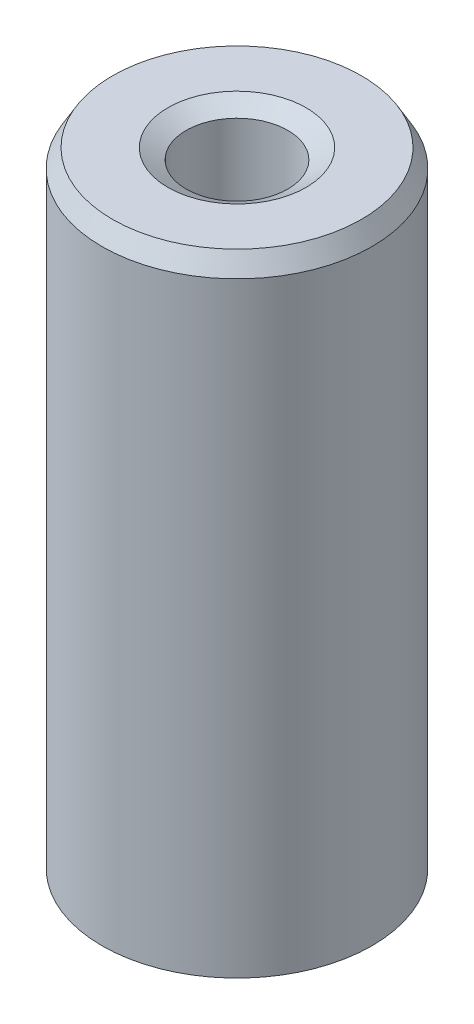
ISO-10303-21;
HEADER;
FILE_DESCRIPTION(('STEP AP214'),'2;1');
FILE_NAME('part.step','',(''),(''),'','','');
FILE_SCHEMA(('AUTOMOTIVE_DESIGN { 1 0 10303 214 1 1 1 1 }'));
ENDSEC;
DATA;
#1=APPLICATION_CONTEXT('core data for automotive mechanical design processes');
#2=APPLICATION_PROTOCOL_DEFINITION('international standard','automotive_design',2000,#1);
#3=PRODUCT_CONTEXT('',#1,'mechanical');
#4=PRODUCT('Part','Part','',(#3));
#5=PRODUCT_RELATED_PRODUCT_CATEGORY('part','',(#4));
#6=PRODUCT_DEFINITION_FORMATION('','',#4);
#7=PRODUCT_DEFINITION_CONTEXT('part definition',#1,'design');
#8=PRODUCT_DEFINITION('design','',#6,#7);
#9=PRODUCT_DEFINITION_SHAPE('','',#8);
#10=(LENGTH_UNIT() NAMED_UNIT(*) SI_UNIT(.MILLI.,.METRE.));
#11=(NAMED_UNIT(*) PLANE_ANGLE_UNIT() SI_UNIT($,.RADIAN.));
#12=(NAMED_UNIT(*) SI_UNIT($,.STERADIAN.) SOLID_ANGLE_UNIT());
#13=UNCERTAINTY_MEASURE_WITH_UNIT(LENGTH_MEASURE(1.E-05),#10,'distance_accuracy_value','');
#14=(GEOMETRIC_REPRESENTATION_CONTEXT(3) GLOBAL_UNCERTAINTY_ASSIGNED_CONTEXT((#13)) GLOBAL_UNIT_ASSIGNED_CONTEXT((#10,
#11,#12)) REPRESENTATION_CONTEXT('',''));
#15=CARTESIAN_POINT('',(0.,0.,0.));
#16=DIRECTION('',(0.,0.,1.));
#17=DIRECTION('',(1.,0.,0.));
#18=AXIS2_PLACEMENT_3D('',#15,#16,#17);
#19=CARTESIAN_POINT('',(0.,117.474514255396,0.));
#20=DIRECTION('',(0.,-1.,0.));
#21=DIRECTION('',(0.,0.,-1.));
#22=AXIS2_PLACEMENT_3D('',#19,#20,#21);
#23=CYLINDRICAL_SURFACE('',#22,25.);
#24=CARTESIAN_POINT('',(0.,1.95128905700256,0.));
#25=DIRECTION('',(0.,1.,0.));
#26=DIRECTION('',(0.,0.,1.));
#27=AXIS2_PLACEMENT_3D('',#24,#25,#26);
#28=CIRCLE('',#27,25.);
#29=CARTESIAN_POINT('',(0.,1.95128905700256,25.));
#30=VERTEX_POINT('',#29);
#31=EDGE_CURVE('E10',#30,#30,#28,.T.);
#32=ORIENTED_EDGE('',*,*,#31,.T.);
#33=EDGE_LOOP('',(#32));
#34=FACE_BOUND('',#33,.T.);
#35=CARTESIAN_POINT('',(0.,114.094782468415,0.));
#36=DIRECTION('',(0.,1.,0.));
#37=DIRECTION('',(0.,0.,1.));
#38=AXIS2_PLACEMENT_3D('',#35,#36,#37);
#39=CIRCLE('',#38,25.);
#40=CARTESIAN_POINT('',(0.,114.094782468415,25.));
#41=VERTEX_POINT('',#40);
#42=EDGE_CURVE('E50',#41,#41,#39,.F.);
#43=ORIENTED_EDGE('',*,*,#42,.T.);
#44=EDGE_LOOP('',(#43));
#45=FACE_BOUND('',#44,.T.);
#46=ADVANCED_FACE('F39',(#34,#45),#23,.T.);
#47=CARTESIAN_POINT('',(0.,117.474514255396,0.));
#48=DIRECTION('',(0.,1.,0.));
#49=DIRECTION('',(0.,0.,1.));
#50=AXIS2_PLACEMENT_3D('',#47,#48,#49);
#51=PLANE('',#50);
#52=CARTESIAN_POINT('',(0.,117.474514255396,0.));
#53=DIRECTION('',(0.,1.,0.));
#54=DIRECTION('',(0.,0.,1.));
#55=AXIS2_PLACEMENT_3D('',#52,#53,#54);
#56=CIRCLE('',#55,12.7970107156764);
#57=CARTESIAN_POINT('',(0.,117.474514255396,12.7970107156764));
#58=VERTEX_POINT('',#57);
#59=EDGE_CURVE('E58',#58,#58,#56,.F.);
#60=ORIENTED_EDGE('',*,*,#59,.T.);
#61=EDGE_LOOP('',(#60));
#62=FACE_BOUND('',#61,.T.);
#63=CARTESIAN_POINT('',(0.,117.474514255396,0.));
#64=DIRECTION('',(0.,1.,0.));
#65=DIRECTION('',(0.,0.,1.));
#66=AXIS2_PLACEMENT_3D('',#63,#64,#65);
#67=CIRCLE('',#66,23.0487109429974);
#68=CARTESIAN_POINT('',(0.,117.474514255396,23.0487109429974));
#69=VERTEX_POINT('',#68);
#70=EDGE_CURVE('E61',#69,#69,#67,.T.);
#71=ORIENTED_EDGE('',*,*,#70,.T.);
#72=EDGE_LOOP('',(#71));
#73=FACE_BOUND('',#72,.T.);
#74=ADVANCED_FACE('F88',(#62,#73),#51,.T.);
#75=CARTESIAN_POINT('',(0.,0.,0.));
#76=DIRECTION('',(0.,1.,0.));
#77=DIRECTION('',(0.,0.,1.));
#78=AXIS2_PLACEMENT_3D('',#75,#76,#77);
#79=PLANE('',#78);
#80=CARTESIAN_POINT('',(0.,0.,0.));
#81=DIRECTION('',(0.,1.,0.));
#82=DIRECTION('',(0.,0.,1.));
#83=AXIS2_PLACEMENT_3D('',#80,#81,#82);
#84=CIRCLE('',#83,11.3685679856973);
#85=CARTESIAN_POINT('',(0.,0.,11.3685679856973));
#86=VERTEX_POINT('',#85);
#87=EDGE_CURVE('E51',#86,#86,#84,.T.);
#88=ORIENTED_EDGE('',*,*,#87,.T.);
#89=EDGE_LOOP('',(#88));
#90=FACE_BOUND('',#89,.T.);
#91=CARTESIAN_POINT('',(0.,0.,0.));
#92=DIRECTION('',(0.,1.,0.));
#93=DIRECTION('',(0.,0.,1.));
#94=AXIS2_PLACEMENT_3D('',#91,#92,#93);
#95=CIRCLE('',#94,21.6202682130184);
#96=CARTESIAN_POINT('',(0.,0.,21.6202682130184));
#97=VERTEX_POINT('',#96);
#98=EDGE_CURVE('E54',#97,#97,#95,.F.);
#99=ORIENTED_EDGE('',*,*,#98,.T.);
#100=EDGE_LOOP('',(#99));
#101=FACE_BOUND('',#100,.T.);
#102=ADVANCED_FACE('F83',(#90,#101),#79,.F.);
#103=CARTESIAN_POINT('',(0.,117.474514255396,0.));
#104=DIRECTION('',(0.,-1.,0.));
#105=DIRECTION('',(0.,0.,-1.));
#106=AXIS2_PLACEMENT_3D('',#103,#104,#105);
#107=CYLINDRICAL_SURFACE('',#106,9.41727892869473);
#108=CARTESIAN_POINT('',(0.,115.523225198394,0.));
#109=DIRECTION('',(0.,1.,0.));
#110=DIRECTION('',(0.,0.,1.));
#111=AXIS2_PLACEMENT_3D('',#108,#109,#110);
#112=CIRCLE('',#111,9.41727892869473);
#113=CARTESIAN_POINT('',(0.,115.523225198394,9.41727892869473));
#114=VERTEX_POINT('',#113);
#115=EDGE_CURVE('E67',#114,#114,#112,.T.);
#116=ORIENTED_EDGE('',*,*,#115,.T.);
#117=EDGE_LOOP('',(#116));
#118=FACE_BOUND('',#117,.T.);
#119=CARTESIAN_POINT('',(0.,3.37973178698163,0.));
#120=DIRECTION('',(0.,1.,0.));
#121=DIRECTION('',(0.,0.,1.));
#122=AXIS2_PLACEMENT_3D('',#119,#120,#121);
#123=CIRCLE('',#122,9.41727892869473);
#124=CARTESIAN_POINT('',(0.,3.37973178698163,9.41727892869473));
#125=VERTEX_POINT('',#124);
#126=EDGE_CURVE('E69',#125,#125,#123,.F.);
#127=ORIENTED_EDGE('',*,*,#126,.T.);
#128=EDGE_LOOP('',(#127));
#129=FACE_BOUND('',#128,.T.);
#130=ADVANCED_FACE('F71',(#118,#129),#107,.F.);
#131=CARTESIAN_POINT('',(0.,115.523225198394,0.));
#132=DIRECTION('',(0.,1.,0.));
#133=DIRECTION('',(0.,0.,1.));
#134=AXIS2_PLACEMENT_3D('',#131,#132,#133);
#135=CONICAL_SURFACE('',#134,9.41727892869473,1.0471975511966);
#136=ORIENTED_EDGE('',*,*,#59,.F.);
#137=EDGE_LOOP('',(#136));
#138=FACE_BOUND('',#137,.T.);
#139=ORIENTED_EDGE('',*,*,#115,.F.);
#140=EDGE_LOOP('',(#139));
#141=FACE_BOUND('',#140,.T.);
#142=ADVANCED_FACE('F77',(#138,#141),#135,.F.);
#143=CARTESIAN_POINT('',(0.,0.,0.));
#144=DIRECTION('',(0.,-1.,0.));
#145=DIRECTION('',(0.,0.,-1.));
#146=AXIS2_PLACEMENT_3D('',#143,#144,#145);
#147=CONICAL_SURFACE('',#146,11.3685679856973,0.523598775598295);
#148=ORIENTED_EDGE('',*,*,#126,.F.);
#149=EDGE_LOOP('',(#148));
#150=FACE_BOUND('',#149,.T.);
#151=ORIENTED_EDGE('',*,*,#87,.F.);
#152=EDGE_LOOP('',(#151));
#153=FACE_BOUND('',#152,.T.);
#154=ADVANCED_FACE('F73',(#150,#153),#147,.F.);
#155=CARTESIAN_POINT('',(0.,1.95128905700256,0.));
#156=DIRECTION('',(0.,1.,0.));
#157=DIRECTION('',(0.,0.,1.));
#158=AXIS2_PLACEMENT_3D('',#155,#156,#157);
#159=CONICAL_SURFACE('',#158,25.,1.0471975511966);
#160=ORIENTED_EDGE('',*,*,#98,.F.);
#161=EDGE_LOOP('',(#160));
#162=FACE_BOUND('',#161,.T.);
#163=ORIENTED_EDGE('',*,*,#31,.F.);
#164=EDGE_LOOP('',(#163));
#165=FACE_BOUND('',#164,.T.);
#166=ADVANCED_FACE('F76',(#162,#165),#159,.T.);
#167=CARTESIAN_POINT('',(0.,117.474514255396,0.));
#168=DIRECTION('',(0.,-1.,0.));
#169=DIRECTION('',(0.,0.,-1.));
#170=AXIS2_PLACEMENT_3D('',#167,#168,#169);
#171=CONICAL_SURFACE('',#170,23.0487109429974,0.523598775598294);
#172=ORIENTED_EDGE('',*,*,#42,.F.);
#173=EDGE_LOOP('',(#172));
#174=FACE_BOUND('',#173,.T.);
#175=ORIENTED_EDGE('',*,*,#70,.F.);
#176=EDGE_LOOP('',(#175));
#177=FACE_BOUND('',#176,.T.);
#178=ADVANCED_FACE('F45',(#174,#177),#171,.T.);
#179=CLOSED_SHELL('',(#46,#74,#102,#130,#142,#154,#166,#178));
#180=MANIFOLD_SOLID_BREP('B2',#179);
#181=ADVANCED_BREP_SHAPE_REPRESENTATION('',(#18,#180),#14);
#182=SHAPE_DEFINITION_REPRESENTATION(#9,#181);
ENDSEC;
END-ISO-10303-21;
